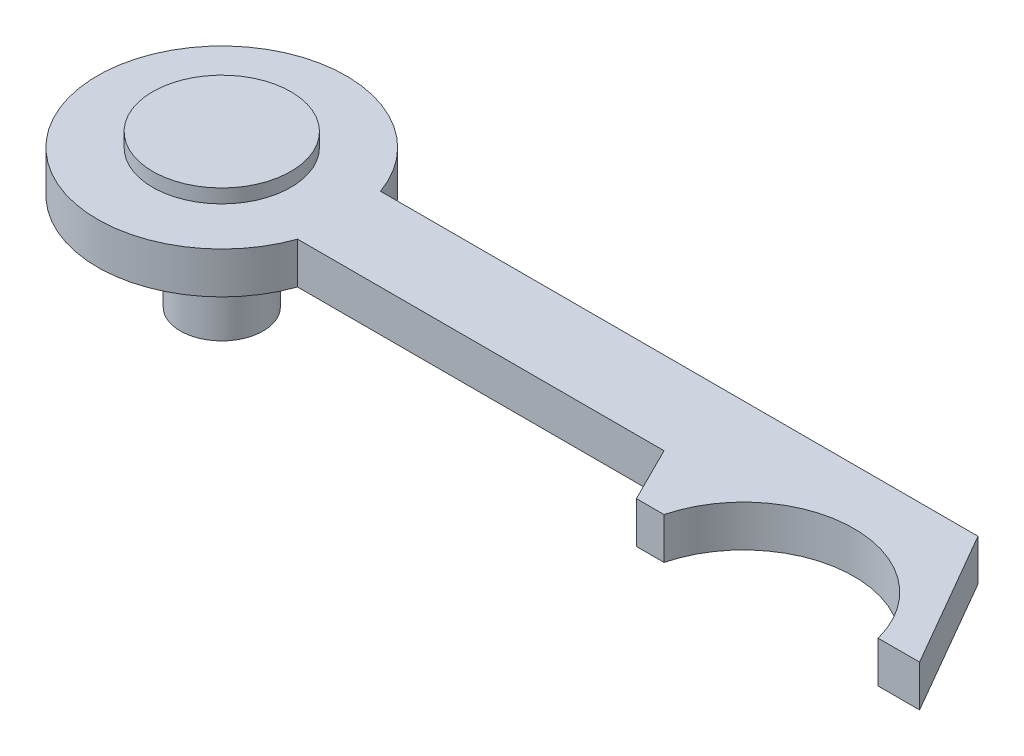
ISO-10303-21;
HEADER;
FILE_DESCRIPTION(('STEP AP214'),'2;1');
FILE_NAME('part.step','',(''),(''),'','','');
FILE_SCHEMA(('AUTOMOTIVE_DESIGN { 1 0 10303 214 1 1 1 1 }'));
ENDSEC;
DATA;
#1=APPLICATION_CONTEXT('core data for automotive mechanical design processes');
#2=APPLICATION_PROTOCOL_DEFINITION('international standard','automotive_design',2000,#1);
#3=PRODUCT_CONTEXT('',#1,'mechanical');
#4=PRODUCT('Part','Part','',(#3));
#5=PRODUCT_RELATED_PRODUCT_CATEGORY('part','',(#4));
#6=PRODUCT_DEFINITION_FORMATION('','',#4);
#7=PRODUCT_DEFINITION_CONTEXT('part definition',#1,'design');
#8=PRODUCT_DEFINITION('design','',#6,#7);
#9=PRODUCT_DEFINITION_SHAPE('','',#8);
#10=(LENGTH_UNIT() NAMED_UNIT(*) SI_UNIT(.MILLI.,.METRE.));
#11=(NAMED_UNIT(*) PLANE_ANGLE_UNIT() SI_UNIT($,.RADIAN.));
#12=(NAMED_UNIT(*) SI_UNIT($,.STERADIAN.) SOLID_ANGLE_UNIT());
#13=UNCERTAINTY_MEASURE_WITH_UNIT(LENGTH_MEASURE(1.E-05),#10,'distance_accuracy_value','');
#14=(GEOMETRIC_REPRESENTATION_CONTEXT(3) GLOBAL_UNCERTAINTY_ASSIGNED_CONTEXT((#13)) GLOBAL_UNIT_ASSIGNED_CONTEXT((#10,
#11,#12)) REPRESENTATION_CONTEXT('',''));
#15=CARTESIAN_POINT('',(0.,0.,0.));
#16=DIRECTION('',(0.,0.,1.));
#17=DIRECTION('',(1.,0.,0.));
#18=AXIS2_PLACEMENT_3D('',#15,#16,#17);
#19=CARTESIAN_POINT('',(0.,4.,0.));
#20=DIRECTION('',(0.,-1.,0.));
#21=DIRECTION('',(1.,0.,0.));
#22=AXIS2_PLACEMENT_3D('',#19,#20,#21);
#23=PLANE('',#22);
#24=CARTESIAN_POINT('',(0.,4.,0.));
#25=DIRECTION('',(0.,-1.,0.));
#26=DIRECTION('',(-1.,0.,0.));
#27=AXIS2_PLACEMENT_3D('',#24,#25,#26);
#28=CIRCLE('',#27,5.);
#29=CARTESIAN_POINT('',(-5.,4.,0.));
#30=VERTEX_POINT('',#29);
#31=EDGE_CURVE('E11',#30,#30,#28,.T.);
#32=ORIENTED_EDGE('',*,*,#31,.F.);
#33=EDGE_LOOP('',(#32));
#34=FACE_BOUND('',#33,.T.);
#35=ADVANCED_FACE('F43',(#34),#23,.F.);
#36=CARTESIAN_POINT('',(0.,3.,0.));
#37=DIRECTION('',(0.,1.,0.));
#38=DIRECTION('',(-1.,0.,0.));
#39=AXIS2_PLACEMENT_3D('',#36,#37,#38);
#40=CYLINDRICAL_SURFACE('',#39,5.);
#41=ORIENTED_EDGE('',*,*,#31,.T.);
#42=EDGE_LOOP('',(#41));
#43=FACE_BOUND('',#42,.T.);
#44=CARTESIAN_POINT('',(0.,3.,0.));
#45=DIRECTION('',(0.,-1.,0.));
#46=DIRECTION('',(-1.,0.,0.));
#47=AXIS2_PLACEMENT_3D('',#44,#45,#46);
#48=CIRCLE('',#47,5.);
#49=CARTESIAN_POINT('',(-5.,3.,0.));
#50=VERTEX_POINT('',#49);
#51=EDGE_CURVE('E49',#50,#50,#48,.T.);
#52=ORIENTED_EDGE('',*,*,#51,.F.);
#53=EDGE_LOOP('',(#52));
#54=FACE_BOUND('',#53,.T.);
#55=ADVANCED_FACE('F75',(#43,#54),#40,.T.);
#56=CARTESIAN_POINT('',(5.,3.,0.));
#57=DIRECTION('',(0.,1.,0.));
#58=DIRECTION('',(-1.,0.,0.));
#59=AXIS2_PLACEMENT_3D('',#56,#57,#58);
#60=PLANE('',#59);
#61=ORIENTED_EDGE('',*,*,#51,.T.);
#62=EDGE_LOOP('',(#61));
#63=FACE_BOUND('',#62,.T.);
#64=CARTESIAN_POINT('',(0.,3.,0.));
#65=DIRECTION('',(0.,-1.,0.));
#66=DIRECTION('',(-1.,0.,0.));
#67=AXIS2_PLACEMENT_3D('',#64,#65,#66);
#68=CIRCLE('',#67,3.);
#69=CARTESIAN_POINT('',(-3.,3.,0.));
#70=VERTEX_POINT('',#69);
#71=EDGE_CURVE('E53',#70,#70,#68,.T.);
#72=ORIENTED_EDGE('',*,*,#71,.F.);
#73=EDGE_LOOP('',(#72));
#74=FACE_BOUND('',#73,.T.);
#75=ADVANCED_FACE('F67',(#63,#74),#60,.F.);
#76=CARTESIAN_POINT('',(0.,3.,0.));
#77=DIRECTION('',(0.,1.,0.));
#78=DIRECTION('',(-1.,0.,0.));
#79=AXIS2_PLACEMENT_3D('',#76,#77,#78);
#80=CYLINDRICAL_SURFACE('',#79,3.);
#81=ORIENTED_EDGE('',*,*,#71,.T.);
#82=EDGE_LOOP('',(#81));
#83=FACE_BOUND('',#82,.T.);
#84=CARTESIAN_POINT('',(0.,-7.,0.));
#85=DIRECTION('',(0.,-1.,0.));
#86=DIRECTION('',(-1.,0.,0.));
#87=AXIS2_PLACEMENT_3D('',#84,#85,#86);
#88=CIRCLE('',#87,3.);
#89=CARTESIAN_POINT('',(-3.,-7.,0.));
#90=VERTEX_POINT('',#89);
#91=EDGE_CURVE('E57',#90,#90,#88,.T.);
#92=ORIENTED_EDGE('',*,*,#91,.F.);
#93=EDGE_LOOP('',(#92));
#94=FACE_BOUND('',#93,.T.);
#95=ADVANCED_FACE('F65',(#83,#94),#80,.T.);
#96=CARTESIAN_POINT('',(3.,-7.,0.));
#97=DIRECTION('',(0.,1.,0.));
#98=DIRECTION('',(-1.,0.,0.));
#99=AXIS2_PLACEMENT_3D('',#96,#97,#98);
#100=PLANE('',#99);
#101=ORIENTED_EDGE('',*,*,#91,.T.);
#102=EDGE_LOOP('',(#101));
#103=FACE_BOUND('',#102,.T.);
#104=ADVANCED_FACE('F63',(#103),#100,.F.);
#105=CLOSED_SHELL('',(#35,#55,#75,#95,#104));
#106=MANIFOLD_SOLID_BREP('B2',#105);
#107=CARTESIAN_POINT('',(0.,3.,0.));
#108=DIRECTION('',(0.,1.,0.));
#109=DIRECTION('',(0.,0.,-1.));
#110=AXIS2_PLACEMENT_3D('',#107,#108,#109);
#111=PLANE('',#110);
#112=CARTESIAN_POINT('',(0.,3.,0.));
#113=DIRECTION('',(0.,-1.,0.));
#114=DIRECTION('',(0.,0.,-1.));
#115=AXIS2_PLACEMENT_3D('',#112,#113,#114);
#116=CIRCLE('',#115,9.);
#117=CARTESIAN_POINT('',(8.48528137423857,3.,3.));
#118=VERTEX_POINT('',#117);
#119=CARTESIAN_POINT('',(8.48528137423857,3.,-3.));
#120=VERTEX_POINT('',#119);
#121=EDGE_CURVE('E41',#118,#120,#116,.T.);
#122=ORIENTED_EDGE('',*,*,#121,.F.);
#123=DIRECTION('',(-1.,0.,0.));
#124=VECTOR('',#123,1.);
#125=CARTESIAN_POINT('',(8.48528137423857,3.,3.));
#126=LINE('',#125,#124);
#127=CARTESIAN_POINT('',(35.,3.,3.));
#128=VERTEX_POINT('',#127);
#129=EDGE_CURVE('E227',#128,#118,#126,.T.);
#130=ORIENTED_EDGE('',*,*,#129,.F.);
#131=DIRECTION('',(-0.447213595499958,0.,-0.894427190999916));
#132=VECTOR('',#131,1.);
#133=CARTESIAN_POINT('',(35.,3.,3.));
#134=LINE('',#133,#132);
#135=CARTESIAN_POINT('',(37.,3.,7.));
#136=VERTEX_POINT('',#135);
#137=EDGE_CURVE('E225',#136,#128,#134,.T.);
#138=ORIENTED_EDGE('',*,*,#137,.F.);
#139=DIRECTION('',(-1.,0.,0.));
#140=VECTOR('',#139,1.);
#141=CARTESIAN_POINT('',(37.,3.,7.));
#142=LINE('',#141,#140);
#143=CARTESIAN_POINT('',(39.,3.,7.));
#144=VERTEX_POINT('',#143);
#145=EDGE_CURVE('E189',#144,#136,#142,.T.);
#146=ORIENTED_EDGE('',*,*,#145,.F.);
#147=CARTESIAN_POINT('',(46.7459666924148,3.,9.));
#148=DIRECTION('',(0.,1.,0.));
#149=DIRECTION('',(0.,0.,-1.));
#150=AXIS2_PLACEMENT_3D('',#147,#148,#149);
#151=CIRCLE('',#150,8.);
#152=CARTESIAN_POINT('',(54.4919333848297,3.,7.));
#153=VERTEX_POINT('',#152);
#154=EDGE_CURVE('E221',#153,#144,#151,.T.);
#155=ORIENTED_EDGE('',*,*,#154,.F.);
#156=DIRECTION('',(-1.,0.,0.));
#157=VECTOR('',#156,1.);
#158=CARTESIAN_POINT('',(54.4919333848297,3.,7.));
#159=LINE('',#158,#157);
#160=CARTESIAN_POINT('',(57.4919333848297,3.,7.));
#161=VERTEX_POINT('',#160);
#162=EDGE_CURVE('E218',#161,#153,#159,.T.);
#163=ORIENTED_EDGE('',*,*,#162,.F.);
#164=DIRECTION('',(0.499999999999998,0.,0.86602540378444));
#165=VECTOR('',#164,1.);
#166=CARTESIAN_POINT('',(57.4919333848297,3.,7.));
#167=LINE('',#166,#165);
#168=CARTESIAN_POINT('',(51.7184306929335,3.,-3.));
#169=VERTEX_POINT('',#168);
#170=EDGE_CURVE('E215',#169,#161,#167,.T.);
#171=ORIENTED_EDGE('',*,*,#170,.F.);
#172=DIRECTION('',(1.,0.,0.));
#173=VECTOR('',#172,1.);
#174=CARTESIAN_POINT('',(51.7184306929335,3.,-3.));
#175=LINE('',#174,#173);
#176=EDGE_CURVE('E212',#120,#169,#175,.T.);
#177=ORIENTED_EDGE('',*,*,#176,.F.);
#178=EDGE_LOOP('',(#122,#130,#138,#146,#155,#163,#171,#177));
#179=FACE_BOUND('',#178,.T.);
#180=CARTESIAN_POINT('',(0.,3.,0.));
#181=DIRECTION('',(0.,-1.,0.));
#182=DIRECTION('',(0.,0.,-1.));
#183=AXIS2_PLACEMENT_3D('',#180,#181,#182);
#184=CIRCLE('',#183,3.);
#185=CARTESIAN_POINT('',(0.,3.,-3.));
#186=VERTEX_POINT('',#185);
#187=EDGE_CURVE('E241',#186,#186,#184,.T.);
#188=ORIENTED_EDGE('',*,*,#187,.T.);
#189=EDGE_LOOP('',(#188));
#190=FACE_BOUND('',#189,.T.);
#191=ADVANCED_FACE('F114',(#179,#190),#111,.T.);
#192=CARTESIAN_POINT('',(0.,0.,0.));
#193=DIRECTION('',(0.,1.,0.));
#194=DIRECTION('',(0.,0.,-1.));
#195=AXIS2_PLACEMENT_3D('',#192,#193,#194);
#196=PLANE('',#195);
#197=CARTESIAN_POINT('',(0.,0.,0.));
#198=DIRECTION('',(0.,-1.,0.));
#199=DIRECTION('',(0.,0.,-1.));
#200=AXIS2_PLACEMENT_3D('',#197,#198,#199);
#201=CIRCLE('',#200,9.);
#202=CARTESIAN_POINT('',(8.48528137423857,0.,3.));
#203=VERTEX_POINT('',#202);
#204=CARTESIAN_POINT('',(8.48528137423857,0.,-3.));
#205=VERTEX_POINT('',#204);
#206=EDGE_CURVE('E118',#203,#205,#201,.T.);
#207=ORIENTED_EDGE('',*,*,#206,.T.);
#208=DIRECTION('',(1.,0.,0.));
#209=VECTOR('',#208,1.);
#210=CARTESIAN_POINT('',(51.7184306929335,0.,-3.));
#211=LINE('',#210,#209);
#212=CARTESIAN_POINT('',(51.7184306929335,0.,-3.));
#213=VERTEX_POINT('',#212);
#214=EDGE_CURVE('E229',#205,#213,#211,.T.);
#215=ORIENTED_EDGE('',*,*,#214,.T.);
#216=DIRECTION('',(0.499999999999998,0.,0.86602540378444));
#217=VECTOR('',#216,1.);
#218=CARTESIAN_POINT('',(57.4919333848297,0.,7.));
#219=LINE('',#218,#217);
#220=CARTESIAN_POINT('',(57.4919333848297,0.,7.));
#221=VERTEX_POINT('',#220);
#222=EDGE_CURVE('E292',#213,#221,#219,.T.);
#223=ORIENTED_EDGE('',*,*,#222,.T.);
#224=DIRECTION('',(-1.,0.,0.));
#225=VECTOR('',#224,1.);
#226=CARTESIAN_POINT('',(54.4919333848297,0.,7.));
#227=LINE('',#226,#225);
#228=CARTESIAN_POINT('',(54.4919333848297,0.,7.));
#229=VERTEX_POINT('',#228);
#230=EDGE_CURVE('E207',#221,#229,#227,.T.);
#231=ORIENTED_EDGE('',*,*,#230,.T.);
#232=CARTESIAN_POINT('',(46.7459666924148,0.,9.));
#233=DIRECTION('',(0.,1.,0.));
#234=DIRECTION('',(0.,0.,-1.));
#235=AXIS2_PLACEMENT_3D('',#232,#233,#234);
#236=CIRCLE('',#235,8.);
#237=CARTESIAN_POINT('',(39.,0.,7.));
#238=VERTEX_POINT('',#237);
#239=EDGE_CURVE('E205',#229,#238,#236,.T.);
#240=ORIENTED_EDGE('',*,*,#239,.T.);
#241=DIRECTION('',(-1.,0.,0.));
#242=VECTOR('',#241,1.);
#243=CARTESIAN_POINT('',(37.,0.,7.));
#244=LINE('',#243,#242);
#245=CARTESIAN_POINT('',(37.,0.,7.));
#246=VERTEX_POINT('',#245);
#247=EDGE_CURVE('E186',#238,#246,#244,.T.);
#248=ORIENTED_EDGE('',*,*,#247,.T.);
#249=DIRECTION('',(-0.447213595499958,0.,-0.894427190999916));
#250=VECTOR('',#249,1.);
#251=CARTESIAN_POINT('',(35.,0.,3.));
#252=LINE('',#251,#250);
#253=CARTESIAN_POINT('',(35.,0.,3.));
#254=VERTEX_POINT('',#253);
#255=EDGE_CURVE('E195',#246,#254,#252,.T.);
#256=ORIENTED_EDGE('',*,*,#255,.T.);
#257=DIRECTION('',(-1.,0.,0.));
#258=VECTOR('',#257,1.);
#259=CARTESIAN_POINT('',(8.48528137423857,0.,3.));
#260=LINE('',#259,#258);
#261=EDGE_CURVE('E198',#254,#203,#260,.T.);
#262=ORIENTED_EDGE('',*,*,#261,.T.);
#263=EDGE_LOOP('',(#207,#215,#223,#231,#240,#248,#256,#262));
#264=FACE_BOUND('',#263,.T.);
#265=CARTESIAN_POINT('',(0.,0.,0.));
#266=DIRECTION('',(0.,-1.,0.));
#267=DIRECTION('',(0.,0.,-1.));
#268=AXIS2_PLACEMENT_3D('',#265,#266,#267);
#269=CIRCLE('',#268,3.);
#270=CARTESIAN_POINT('',(0.,0.,-3.));
#271=VERTEX_POINT('',#270);
#272=EDGE_CURVE('E231',#271,#271,#269,.T.);
#273=ORIENTED_EDGE('',*,*,#272,.F.);
#274=EDGE_LOOP('',(#273));
#275=FACE_BOUND('',#274,.T.);
#276=ADVANCED_FACE('F201',(#264,#275),#196,.F.);
#277=CARTESIAN_POINT('',(0.,3.,0.));
#278=DIRECTION('',(0.,-1.,0.));
#279=DIRECTION('',(0.,0.,1.));
#280=AXIS2_PLACEMENT_3D('',#277,#278,#279);
#281=CYLINDRICAL_SURFACE('',#280,9.);
#282=ORIENTED_EDGE('',*,*,#121,.T.);
#283=DIRECTION('',(0.,1.,0.));
#284=VECTOR('',#283,1.);
#285=CARTESIAN_POINT('',(8.48528137423857,0.,-3.));
#286=LINE('',#285,#284);
#287=EDGE_CURVE('E165',#205,#120,#286,.T.);
#288=ORIENTED_EDGE('',*,*,#287,.F.);
#289=ORIENTED_EDGE('',*,*,#206,.F.);
#290=DIRECTION('',(0.,1.,0.));
#291=VECTOR('',#290,1.);
#292=CARTESIAN_POINT('',(8.48528137423857,0.,3.));
#293=LINE('',#292,#291);
#294=EDGE_CURVE('E128',#203,#118,#293,.T.);
#295=ORIENTED_EDGE('',*,*,#294,.T.);
#296=EDGE_LOOP('',(#282,#288,#289,#295));
#297=FACE_BOUND('',#296,.T.);
#298=ADVANCED_FACE('F116',(#297),#281,.T.);
#299=CARTESIAN_POINT('',(0.,3.,0.));
#300=DIRECTION('',(0.,-1.,0.));
#301=DIRECTION('',(0.,0.,1.));
#302=AXIS2_PLACEMENT_3D('',#299,#300,#301);
#303=CYLINDRICAL_SURFACE('',#302,3.);
#304=ORIENTED_EDGE('',*,*,#187,.F.);
#305=EDGE_LOOP('',(#304));
#306=FACE_BOUND('',#305,.T.);
#307=ORIENTED_EDGE('',*,*,#272,.T.);
#308=EDGE_LOOP('',(#307));
#309=FACE_BOUND('',#308,.T.);
#310=ADVANCED_FACE('F247',(#306,#309),#303,.F.);
#311=CARTESIAN_POINT('',(8.48528137423857,0.,3.));
#312=DIRECTION('',(0.,0.,1.));
#313=DIRECTION('',(-1.,0.,0.));
#314=AXIS2_PLACEMENT_3D('',#311,#312,#313);
#315=PLANE('',#314);
#316=ORIENTED_EDGE('',*,*,#129,.T.);
#317=ORIENTED_EDGE('',*,*,#294,.F.);
#318=ORIENTED_EDGE('',*,*,#261,.F.);
#319=DIRECTION('',(0.,1.,0.));
#320=VECTOR('',#319,1.);
#321=CARTESIAN_POINT('',(35.,0.,3.));
#322=LINE('',#321,#320);
#323=EDGE_CURVE('E160',#254,#128,#322,.T.);
#324=ORIENTED_EDGE('',*,*,#323,.T.);
#325=EDGE_LOOP('',(#316,#317,#318,#324));
#326=FACE_BOUND('',#325,.T.);
#327=ADVANCED_FACE('F258',(#326),#315,.T.);
#328=CARTESIAN_POINT('',(35.,0.,3.));
#329=DIRECTION('',(-0.894427190999916,0.,0.447213595499958));
#330=DIRECTION('',(-0.447213595499958,0.,-0.894427190999916));
#331=AXIS2_PLACEMENT_3D('',#328,#329,#330);
#332=PLANE('',#331);
#333=ORIENTED_EDGE('',*,*,#137,.T.);
#334=ORIENTED_EDGE('',*,*,#323,.F.);
#335=ORIENTED_EDGE('',*,*,#255,.F.);
#336=DIRECTION('',(0.,1.,0.));
#337=VECTOR('',#336,1.);
#338=CARTESIAN_POINT('',(37.,0.,7.));
#339=LINE('',#338,#337);
#340=EDGE_CURVE('E182',#246,#136,#339,.T.);
#341=ORIENTED_EDGE('',*,*,#340,.T.);
#342=EDGE_LOOP('',(#333,#334,#335,#341));
#343=FACE_BOUND('',#342,.T.);
#344=ADVANCED_FACE('F196',(#343),#332,.T.);
#345=CARTESIAN_POINT('',(37.,0.,7.));
#346=DIRECTION('',(0.,0.,1.));
#347=DIRECTION('',(-1.,0.,0.));
#348=AXIS2_PLACEMENT_3D('',#345,#346,#347);
#349=PLANE('',#348);
#350=ORIENTED_EDGE('',*,*,#145,.T.);
#351=ORIENTED_EDGE('',*,*,#340,.F.);
#352=ORIENTED_EDGE('',*,*,#247,.F.);
#353=DIRECTION('',(0.,1.,0.));
#354=VECTOR('',#353,1.);
#355=CARTESIAN_POINT('',(39.,0.,7.));
#356=LINE('',#355,#354);
#357=EDGE_CURVE('E192',#238,#144,#356,.T.);
#358=ORIENTED_EDGE('',*,*,#357,.T.);
#359=EDGE_LOOP('',(#350,#351,#352,#358));
#360=FACE_BOUND('',#359,.T.);
#361=ADVANCED_FACE('F184',(#360),#349,.T.);
#362=CARTESIAN_POINT('',(46.7459666924148,0.,9.));
#363=DIRECTION('',(0.,1.,0.));
#364=DIRECTION('',(0.,0.,-1.));
#365=AXIS2_PLACEMENT_3D('',#362,#363,#364);
#366=CYLINDRICAL_SURFACE('',#365,8.);
#367=ORIENTED_EDGE('',*,*,#154,.T.);
#368=ORIENTED_EDGE('',*,*,#357,.F.);
#369=ORIENTED_EDGE('',*,*,#239,.F.);
#370=DIRECTION('',(0.,1.,0.));
#371=VECTOR('',#370,1.);
#372=CARTESIAN_POINT('',(54.4919333848297,0.,7.));
#373=LINE('',#372,#371);
#374=EDGE_CURVE('E234',#229,#153,#373,.T.);
#375=ORIENTED_EDGE('',*,*,#374,.T.);
#376=EDGE_LOOP('',(#367,#368,#369,#375));
#377=FACE_BOUND('',#376,.T.);
#378=ADVANCED_FACE('F271',(#377),#366,.F.);
#379=CARTESIAN_POINT('',(54.4919333848297,0.,7.));
#380=DIRECTION('',(0.,0.,1.));
#381=DIRECTION('',(-1.,0.,0.));
#382=AXIS2_PLACEMENT_3D('',#379,#380,#381);
#383=PLANE('',#382);
#384=ORIENTED_EDGE('',*,*,#162,.T.);
#385=ORIENTED_EDGE('',*,*,#374,.F.);
#386=ORIENTED_EDGE('',*,*,#230,.F.);
#387=DIRECTION('',(0.,1.,0.));
#388=VECTOR('',#387,1.);
#389=CARTESIAN_POINT('',(57.4919333848297,0.,7.));
#390=LINE('',#389,#388);
#391=EDGE_CURVE('E236',#221,#161,#390,.T.);
#392=ORIENTED_EDGE('',*,*,#391,.T.);
#393=EDGE_LOOP('',(#384,#385,#386,#392));
#394=FACE_BOUND('',#393,.T.);
#395=ADVANCED_FACE('F267',(#394),#383,.T.);
#396=CARTESIAN_POINT('',(57.4919333848297,0.,7.));
#397=DIRECTION('',(0.86602540378444,0.,-0.499999999999998));
#398=DIRECTION('',(0.499999999999998,0.,0.86602540378444));
#399=AXIS2_PLACEMENT_3D('',#396,#397,#398);
#400=PLANE('',#399);
#401=ORIENTED_EDGE('',*,*,#170,.T.);
#402=ORIENTED_EDGE('',*,*,#391,.F.);
#403=ORIENTED_EDGE('',*,*,#222,.F.);
#404=DIRECTION('',(0.,1.,0.));
#405=VECTOR('',#404,1.);
#406=CARTESIAN_POINT('',(51.7184306929335,0.,-3.));
#407=LINE('',#406,#405);
#408=EDGE_CURVE('E238',#213,#169,#407,.T.);
#409=ORIENTED_EDGE('',*,*,#408,.T.);
#410=EDGE_LOOP('',(#401,#402,#403,#409));
#411=FACE_BOUND('',#410,.T.);
#412=ADVANCED_FACE('F263',(#411),#400,.T.);
#413=CARTESIAN_POINT('',(51.7184306929335,0.,-3.));
#414=DIRECTION('',(0.,0.,-1.));
#415=DIRECTION('',(1.,0.,0.));
#416=AXIS2_PLACEMENT_3D('',#413,#414,#415);
#417=PLANE('',#416);
#418=ORIENTED_EDGE('',*,*,#176,.T.);
#419=ORIENTED_EDGE('',*,*,#408,.F.);
#420=ORIENTED_EDGE('',*,*,#214,.F.);
#421=ORIENTED_EDGE('',*,*,#287,.T.);
#422=EDGE_LOOP('',(#418,#419,#420,#421));
#423=FACE_BOUND('',#422,.T.);
#424=ADVANCED_FACE('F260',(#423),#417,.T.);
#425=CLOSED_SHELL('',(#191,#276,#298,#310,#327,#344,#361,#378,#395,#412,#424));
#426=MANIFOLD_SOLID_BREP('B6',#425);
#427=ADVANCED_BREP_SHAPE_REPRESENTATION('',(#18,#106,#426),#14);
#428=SHAPE_DEFINITION_REPRESENTATION(#9,#427);
ENDSEC;
END-ISO-10303-21;
